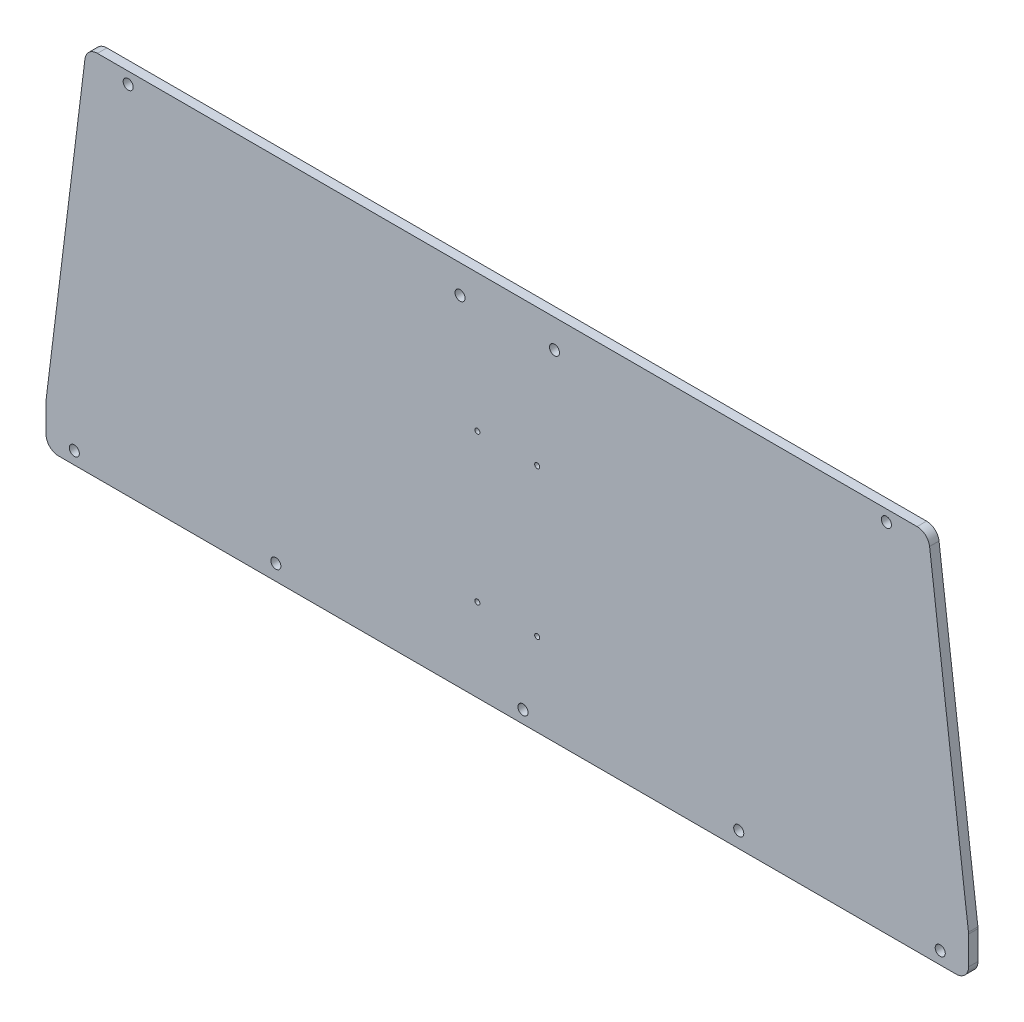
ISO-10303-21;
HEADER;
FILE_DESCRIPTION(('STEP AP214'),'2;1');
FILE_NAME('part.step','',(''),(''),'','','');
FILE_SCHEMA(('AUTOMOTIVE_DESIGN { 1 0 10303 214 1 1 1 1 }'));
ENDSEC;
DATA;
#1=APPLICATION_CONTEXT('core data for automotive mechanical design processes');
#2=APPLICATION_PROTOCOL_DEFINITION('international standard','automotive_design',2000,#1);
#3=PRODUCT_CONTEXT('',#1,'mechanical');
#4=PRODUCT('Part','Part','',(#3));
#5=PRODUCT_RELATED_PRODUCT_CATEGORY('part','',(#4));
#6=PRODUCT_DEFINITION_FORMATION('','',#4);
#7=PRODUCT_DEFINITION_CONTEXT('part definition',#1,'design');
#8=PRODUCT_DEFINITION('design','',#6,#7);
#9=PRODUCT_DEFINITION_SHAPE('','',#8);
#10=(LENGTH_UNIT() NAMED_UNIT(*) SI_UNIT(.MILLI.,.METRE.));
#11=(NAMED_UNIT(*) PLANE_ANGLE_UNIT() SI_UNIT($,.RADIAN.));
#12=(NAMED_UNIT(*) SI_UNIT($,.STERADIAN.) SOLID_ANGLE_UNIT());
#13=UNCERTAINTY_MEASURE_WITH_UNIT(LENGTH_MEASURE(1.E-05),#10,'distance_accuracy_value','');
#14=(GEOMETRIC_REPRESENTATION_CONTEXT(3) GLOBAL_UNCERTAINTY_ASSIGNED_CONTEXT((#13)) GLOBAL_UNIT_ASSIGNED_CONTEXT((#10,
#11,#12)) REPRESENTATION_CONTEXT('',''));
#15=CARTESIAN_POINT('',(0.,0.,0.));
#16=DIRECTION('',(0.,0.,1.));
#17=DIRECTION('',(1.,0.,0.));
#18=AXIS2_PLACEMENT_3D('',#15,#16,#17);
#19=CARTESIAN_POINT('',(-142.556822226775,-0.579261564720194,-3.));
#20=DIRECTION('',(0.,0.,1.));
#21=DIRECTION('',(1.,0.,0.));
#22=AXIS2_PLACEMENT_3D('',#19,#20,#21);
#23=ELLIPSE('',#22,4.,3.97598833634421);
#24=DIRECTION('',(0.,0.,1.));
#25=VECTOR('',#24,1.);
#26=SURFACE_OF_LINEAR_EXTRUSION('',#23,#25);
#27=CARTESIAN_POINT('',(-142.556822226775,-0.579261564720194,0.));
#28=DIRECTION('',(0.,0.,1.));
#29=DIRECTION('',(1.,0.,0.));
#30=AXIS2_PLACEMENT_3D('',#27,#28,#29);
#31=ELLIPSE('',#30,4.,3.97598833634421);
#32=CARTESIAN_POINT('',(-146.556822226775,-0.579261564720194,0.));
#33=VERTEX_POINT('',#32);
#34=CARTESIAN_POINT('',(-142.556822226775,-4.5552499010644,0.));
#35=VERTEX_POINT('',#34);
#36=EDGE_CURVE('E250',#33,#35,#31,.T.);
#37=ORIENTED_EDGE('',*,*,#36,.F.);
#38=DIRECTION('',(0.,0.,1.));
#39=VECTOR('',#38,1.);
#40=CARTESIAN_POINT('',(-146.556822226775,-0.579261564720194,-3.));
#41=LINE('',#40,#39);
#42=CARTESIAN_POINT('',(-146.556822226775,-0.579261564720194,-3.));
#43=VERTEX_POINT('',#42);
#44=EDGE_CURVE('E11',#43,#33,#41,.T.);
#45=ORIENTED_EDGE('',*,*,#44,.F.);
#46=CARTESIAN_POINT('',(-142.556822226775,-4.5552499010644,-3.));
#47=VERTEX_POINT('',#46);
#48=EDGE_CURVE('E251',#43,#47,#23,.T.);
#49=ORIENTED_EDGE('',*,*,#48,.T.);
#50=DIRECTION('',(0.,0.,1.));
#51=VECTOR('',#50,1.);
#52=CARTESIAN_POINT('',(-142.556822226775,-4.5552499010644,-3.));
#53=LINE('',#52,#51);
#54=EDGE_CURVE('E110',#47,#35,#53,.T.);
#55=ORIENTED_EDGE('',*,*,#54,.T.);
#56=EDGE_LOOP('',(#37,#45,#49,#55));
#57=FACE_BOUND('',#56,.T.);
#58=ADVANCED_FACE('F39',(#57),#26,.T.);
#59=CARTESIAN_POINT('',(-146.556822226775,8.46248460910281,-3.));
#60=DIRECTION('',(-1.,0.,0.));
#61=DIRECTION('',(0.,0.,1.));
#62=AXIS2_PLACEMENT_3D('',#59,#60,#61);
#63=PLANE('',#62);
#64=DIRECTION('',(0.,-1.,0.));
#65=VECTOR('',#64,1.);
#66=CARTESIAN_POINT('',(-146.556822226775,8.46248460910281,0.));
#67=LINE('',#66,#65);
#68=CARTESIAN_POINT('',(-146.556822226775,8.46248460910281,0.));
#69=VERTEX_POINT('',#68);
#70=EDGE_CURVE('E255',#69,#33,#67,.T.);
#71=ORIENTED_EDGE('',*,*,#70,.F.);
#72=DIRECTION('',(0.,0.,1.));
#73=VECTOR('',#72,1.);
#74=CARTESIAN_POINT('',(-146.556822226775,8.46248460910281,-3.));
#75=LINE('',#74,#73);
#76=CARTESIAN_POINT('',(-146.556822226775,8.46248460910281,-3.));
#77=VERTEX_POINT('',#76);
#78=EDGE_CURVE('E49',#77,#69,#75,.T.);
#79=ORIENTED_EDGE('',*,*,#78,.F.);
#80=DIRECTION('',(0.,-1.,0.));
#81=VECTOR('',#80,1.);
#82=CARTESIAN_POINT('',(-146.556822226775,8.46248460910281,-3.));
#83=LINE('',#82,#81);
#84=EDGE_CURVE('E156',#77,#43,#83,.T.);
#85=ORIENTED_EDGE('',*,*,#84,.T.);
#86=ORIENTED_EDGE('',*,*,#44,.T.);
#87=EDGE_LOOP('',(#71,#79,#85,#86));
#88=FACE_BOUND('',#87,.T.);
#89=ADVANCED_FACE('F172',(#88),#63,.T.);
#90=CARTESIAN_POINT('',(-142.556822226775,8.46248460910281,-3.));
#91=DIRECTION('',(0.,0.,1.));
#92=DIRECTION('',(1.,0.,0.));
#93=AXIS2_PLACEMENT_3D('',#90,#91,#92);
#94=ELLIPSE('',#93,4.,3.97598833634421);
#95=DIRECTION('',(0.,0.,1.));
#96=VECTOR('',#95,1.);
#97=SURFACE_OF_LINEAR_EXTRUSION('',#94,#96);
#98=CARTESIAN_POINT('',(-142.556822226775,8.46248460910281,0.));
#99=DIRECTION('',(0.,0.,1.));
#100=DIRECTION('',(1.,0.,0.));
#101=AXIS2_PLACEMENT_3D('',#98,#99,#100);
#102=ELLIPSE('',#101,4.,3.97598833634421);
#103=CARTESIAN_POINT('',(-146.52700683334,8.94703569703961,0.));
#104=VERTEX_POINT('',#103);
#105=EDGE_CURVE('E143',#104,#69,#102,.T.);
#106=ORIENTED_EDGE('',*,*,#105,.F.);
#107=DIRECTION('',(0.,0.,1.));
#108=VECTOR('',#107,1.);
#109=CARTESIAN_POINT('',(-146.52700683334,8.94703569703961,-3.));
#110=LINE('',#109,#108);
#111=CARTESIAN_POINT('',(-146.52700683334,8.94703569703961,-3.));
#112=VERTEX_POINT('',#111);
#113=EDGE_CURVE('E138',#112,#104,#110,.T.);
#114=ORIENTED_EDGE('',*,*,#113,.F.);
#115=EDGE_CURVE('E141',#112,#77,#94,.T.);
#116=ORIENTED_EDGE('',*,*,#115,.T.);
#117=ORIENTED_EDGE('',*,*,#78,.T.);
#118=EDGE_LOOP('',(#106,#114,#116,#117));
#119=FACE_BOUND('',#118,.T.);
#120=ADVANCED_FACE('F140',(#119),#97,.T.);
#121=CARTESIAN_POINT('',(-134.178039088322,108.917568146375,-3.));
#122=DIRECTION('',(-0.992456868880227,0.122594304159927,0.));
#123=DIRECTION('',(-0.122594304159927,-0.992456868880227,0.));
#124=AXIS2_PLACEMENT_3D('',#121,#122,#123);
#125=PLANE('',#124);
#126=DIRECTION('',(-0.122594304159927,-0.992456868880227,0.));
#127=VECTOR('',#126,1.);
#128=CARTESIAN_POINT('',(-134.178039088322,108.917568146375,0.));
#129=LINE('',#128,#127);
#130=CARTESIAN_POINT('',(-134.178039088322,108.917568146375,0.));
#131=VERTEX_POINT('',#130);
#132=EDGE_CURVE('E286',#131,#104,#129,.T.);
#133=ORIENTED_EDGE('',*,*,#132,.F.);
#134=DIRECTION('',(0.,0.,1.));
#135=VECTOR('',#134,1.);
#136=CARTESIAN_POINT('',(-134.178039088322,108.917568146375,-3.));
#137=LINE('',#136,#135);
#138=CARTESIAN_POINT('',(-134.178039088322,108.917568146375,-3.));
#139=VERTEX_POINT('',#138);
#140=EDGE_CURVE('E148',#139,#131,#137,.T.);
#141=ORIENTED_EDGE('',*,*,#140,.F.);
#142=DIRECTION('',(-0.122594304159927,-0.992456868880227,0.));
#143=VECTOR('',#142,1.);
#144=CARTESIAN_POINT('',(-134.178039088322,108.917568146375,-3.));
#145=LINE('',#144,#143);
#146=EDGE_CURVE('E154',#139,#112,#145,.T.);
#147=ORIENTED_EDGE('',*,*,#146,.T.);
#148=ORIENTED_EDGE('',*,*,#113,.T.);
#149=EDGE_LOOP('',(#133,#141,#147,#148));
#150=FACE_BOUND('',#149,.T.);
#151=ADVANCED_FACE('F158',(#150),#125,.T.);
#152=CARTESIAN_POINT('',(-130.207854481757,108.433017058438,-3.));
#153=DIRECTION('',(0.,0.,1.));
#154=DIRECTION('',(1.,0.,0.));
#155=AXIS2_PLACEMENT_3D('',#152,#153,#154);
#156=ELLIPSE('',#155,4.,3.9759883363442);
#157=DIRECTION('',(0.,0.,1.));
#158=VECTOR('',#157,1.);
#159=SURFACE_OF_LINEAR_EXTRUSION('',#156,#158);
#160=CARTESIAN_POINT('',(-130.207854481757,108.433017058438,0.));
#161=DIRECTION('',(0.,0.,1.));
#162=DIRECTION('',(1.,0.,0.));
#163=AXIS2_PLACEMENT_3D('',#160,#161,#162);
#164=ELLIPSE('',#163,4.,3.9759883363442);
#165=CARTESIAN_POINT('',(-130.207854481757,112.409005394783,0.));
#166=VERTEX_POINT('',#165);
#167=EDGE_CURVE('E208',#166,#131,#164,.T.);
#168=ORIENTED_EDGE('',*,*,#167,.F.);
#169=DIRECTION('',(0.,0.,1.));
#170=VECTOR('',#169,1.);
#171=CARTESIAN_POINT('',(-130.207854481757,112.409005394783,-3.));
#172=LINE('',#171,#170);
#173=CARTESIAN_POINT('',(-130.207854481757,112.409005394783,-3.));
#174=VERTEX_POINT('',#173);
#175=EDGE_CURVE('E202',#174,#166,#172,.T.);
#176=ORIENTED_EDGE('',*,*,#175,.F.);
#177=EDGE_CURVE('E159',#174,#139,#156,.T.);
#178=ORIENTED_EDGE('',*,*,#177,.T.);
#179=ORIENTED_EDGE('',*,*,#140,.T.);
#180=EDGE_LOOP('',(#168,#176,#178,#179));
#181=FACE_BOUND('',#180,.T.);
#182=ADVANCED_FACE('F176',(#181),#159,.T.);
#183=CARTESIAN_POINT('',(-11.6189500386223,112.409005394783,-3.));
#184=DIRECTION('',(0.,1.,0.));
#185=DIRECTION('',(-1.,0.,0.));
#186=AXIS2_PLACEMENT_3D('',#183,#184,#185);
#187=PLANE('',#186);
#188=DIRECTION('',(-1.,0.,0.));
#189=VECTOR('',#188,1.);
#190=CARTESIAN_POINT('',(-11.6189500386223,112.409005394783,0.));
#191=LINE('',#190,#189);
#192=CARTESIAN_POINT('',(130.207854481756,112.409005394783,0.));
#193=VERTEX_POINT('',#192);
#194=EDGE_CURVE('E292',#193,#166,#191,.T.);
#195=ORIENTED_EDGE('',*,*,#194,.F.);
#196=DIRECTION('',(0.,0.,1.));
#197=VECTOR('',#196,1.);
#198=CARTESIAN_POINT('',(130.207854481756,112.409005394783,-3.));
#199=LINE('',#198,#197);
#200=CARTESIAN_POINT('',(130.207854481756,112.409005394783,-3.));
#201=VERTEX_POINT('',#200);
#202=EDGE_CURVE('E205',#201,#193,#199,.T.);
#203=ORIENTED_EDGE('',*,*,#202,.F.);
#204=DIRECTION('',(-1.,0.,0.));
#205=VECTOR('',#204,1.);
#206=CARTESIAN_POINT('',(130.207854481756,112.409005394783,-3.));
#207=LINE('',#206,#205);
#208=EDGE_CURVE('E161',#201,#174,#207,.T.);
#209=ORIENTED_EDGE('',*,*,#208,.T.);
#210=ORIENTED_EDGE('',*,*,#175,.T.);
#211=EDGE_LOOP('',(#195,#203,#209,#210));
#212=FACE_BOUND('',#211,.T.);
#213=ADVANCED_FACE('F179',(#212),#187,.T.);
#214=CARTESIAN_POINT('',(130.207854481757,108.433017058438,-3.));
#215=DIRECTION('',(0.,0.,1.));
#216=DIRECTION('',(1.,0.,0.));
#217=AXIS2_PLACEMENT_3D('',#214,#215,#216);
#218=ELLIPSE('',#217,4.,3.9759883363442);
#219=DIRECTION('',(0.,0.,1.));
#220=VECTOR('',#219,1.);
#221=SURFACE_OF_LINEAR_EXTRUSION('',#218,#220);
#222=CARTESIAN_POINT('',(130.207854481757,108.433017058438,0.));
#223=DIRECTION('',(0.,0.,1.));
#224=DIRECTION('',(1.,0.,0.));
#225=AXIS2_PLACEMENT_3D('',#222,#223,#224);
#226=ELLIPSE('',#225,4.,3.9759883363442);
#227=CARTESIAN_POINT('',(134.178039088322,108.917568146375,0.));
#228=VERTEX_POINT('',#227);
#229=EDGE_CURVE('E295',#228,#193,#226,.T.);
#230=ORIENTED_EDGE('',*,*,#229,.F.);
#231=DIRECTION('',(0.,0.,1.));
#232=VECTOR('',#231,1.);
#233=CARTESIAN_POINT('',(134.178039088322,108.917568146375,-3.));
#234=LINE('',#233,#232);
#235=CARTESIAN_POINT('',(134.178039088322,108.917568146375,-3.));
#236=VERTEX_POINT('',#235);
#237=EDGE_CURVE('E213',#236,#228,#234,.T.);
#238=ORIENTED_EDGE('',*,*,#237,.F.);
#239=EDGE_CURVE('E191',#236,#201,#218,.T.);
#240=ORIENTED_EDGE('',*,*,#239,.T.);
#241=ORIENTED_EDGE('',*,*,#202,.T.);
#242=EDGE_LOOP('',(#230,#238,#240,#241));
#243=FACE_BOUND('',#242,.T.);
#244=ADVANCED_FACE('F183',(#243),#221,.T.);
#245=CARTESIAN_POINT('',(146.52700683334,8.9470356970396,-3.));
#246=DIRECTION('',(0.992456868880227,0.122594304159927,0.));
#247=DIRECTION('',(-0.122594304159927,0.992456868880227,0.));
#248=AXIS2_PLACEMENT_3D('',#245,#246,#247);
#249=PLANE('',#248);
#250=DIRECTION('',(-0.122594304159927,0.992456868880227,0.));
#251=VECTOR('',#250,1.);
#252=CARTESIAN_POINT('',(146.52700683334,8.9470356970396,0.));
#253=LINE('',#252,#251);
#254=CARTESIAN_POINT('',(146.52700683334,8.9470356970396,0.));
#255=VERTEX_POINT('',#254);
#256=EDGE_CURVE('E299',#255,#228,#253,.T.);
#257=ORIENTED_EDGE('',*,*,#256,.F.);
#258=DIRECTION('',(0.,0.,1.));
#259=VECTOR('',#258,1.);
#260=CARTESIAN_POINT('',(146.52700683334,8.9470356970396,-3.));
#261=LINE('',#260,#259);
#262=CARTESIAN_POINT('',(146.52700683334,8.9470356970396,-3.));
#263=VERTEX_POINT('',#262);
#264=EDGE_CURVE('E217',#263,#255,#261,.T.);
#265=ORIENTED_EDGE('',*,*,#264,.F.);
#266=DIRECTION('',(-0.122594304159927,0.992456868880227,0.));
#267=VECTOR('',#266,1.);
#268=CARTESIAN_POINT('',(146.52700683334,8.9470356970396,-3.));
#269=LINE('',#268,#267);
#270=EDGE_CURVE('E196',#263,#236,#269,.T.);
#271=ORIENTED_EDGE('',*,*,#270,.T.);
#272=ORIENTED_EDGE('',*,*,#237,.T.);
#273=EDGE_LOOP('',(#257,#265,#271,#272));
#274=FACE_BOUND('',#273,.T.);
#275=ADVANCED_FACE('F188',(#274),#249,.T.);
#276=CARTESIAN_POINT('',(142.556822226775,8.46248460910283,-3.));
#277=DIRECTION('',(0.,0.,1.));
#278=DIRECTION('',(1.,0.,0.));
#279=AXIS2_PLACEMENT_3D('',#276,#277,#278);
#280=ELLIPSE('',#279,4.,3.97598833634421);
#281=DIRECTION('',(0.,0.,1.));
#282=VECTOR('',#281,1.);
#283=SURFACE_OF_LINEAR_EXTRUSION('',#280,#282);
#284=CARTESIAN_POINT('',(142.556822226775,8.46248460910283,0.));
#285=DIRECTION('',(0.,0.,1.));
#286=DIRECTION('',(1.,0.,0.));
#287=AXIS2_PLACEMENT_3D('',#284,#285,#286);
#288=ELLIPSE('',#287,4.,3.97598833634421);
#289=CARTESIAN_POINT('',(146.556822226775,8.46248460910284,0.));
#290=VERTEX_POINT('',#289);
#291=EDGE_CURVE('E303',#290,#255,#288,.T.);
#292=ORIENTED_EDGE('',*,*,#291,.F.);
#293=DIRECTION('',(0.,0.,1.));
#294=VECTOR('',#293,1.);
#295=CARTESIAN_POINT('',(146.556822226775,8.46248460910284,-3.));
#296=LINE('',#295,#294);
#297=CARTESIAN_POINT('',(146.556822226775,8.46248460910284,-3.));
#298=VERTEX_POINT('',#297);
#299=EDGE_CURVE('E219',#298,#290,#296,.T.);
#300=ORIENTED_EDGE('',*,*,#299,.F.);
#301=EDGE_CURVE('E324',#298,#263,#280,.T.);
#302=ORIENTED_EDGE('',*,*,#301,.T.);
#303=ORIENTED_EDGE('',*,*,#264,.T.);
#304=EDGE_LOOP('',(#292,#300,#302,#303));
#305=FACE_BOUND('',#304,.T.);
#306=ADVANCED_FACE('F321',(#305),#283,.T.);
#307=CARTESIAN_POINT('',(146.556822226775,-0.579261564720142,-3.));
#308=DIRECTION('',(1.,0.,0.));
#309=DIRECTION('',(0.,1.,0.));
#310=AXIS2_PLACEMENT_3D('',#307,#308,#309);
#311=PLANE('',#310);
#312=DIRECTION('',(0.,1.,0.));
#313=VECTOR('',#312,1.);
#314=CARTESIAN_POINT('',(146.556822226775,-0.579261564720142,0.));
#315=LINE('',#314,#313);
#316=CARTESIAN_POINT('',(146.556822226775,-0.579261564720142,0.));
#317=VERTEX_POINT('',#316);
#318=EDGE_CURVE('E306',#317,#290,#315,.T.);
#319=ORIENTED_EDGE('',*,*,#318,.F.);
#320=DIRECTION('',(0.,0.,1.));
#321=VECTOR('',#320,1.);
#322=CARTESIAN_POINT('',(146.556822226775,-0.579261564720142,-3.));
#323=LINE('',#322,#321);
#324=CARTESIAN_POINT('',(146.556822226775,-0.579261564720142,-3.));
#325=VERTEX_POINT('',#324);
#326=EDGE_CURVE('E221',#325,#317,#323,.T.);
#327=ORIENTED_EDGE('',*,*,#326,.F.);
#328=DIRECTION('',(0.,1.,0.));
#329=VECTOR('',#328,1.);
#330=CARTESIAN_POINT('',(146.556822226775,-0.579261564720142,-3.));
#331=LINE('',#330,#329);
#332=EDGE_CURVE('E261',#325,#298,#331,.T.);
#333=ORIENTED_EDGE('',*,*,#332,.T.);
#334=ORIENTED_EDGE('',*,*,#299,.T.);
#335=EDGE_LOOP('',(#319,#327,#333,#334));
#336=FACE_BOUND('',#335,.T.);
#337=ADVANCED_FACE('F267',(#336),#311,.T.);
#338=CARTESIAN_POINT('',(142.556822226775,-0.579261564720159,-3.));
#339=DIRECTION('',(0.,0.,1.));
#340=DIRECTION('',(1.,0.,0.));
#341=AXIS2_PLACEMENT_3D('',#338,#339,#340);
#342=ELLIPSE('',#341,4.,3.97598833634421);
#343=DIRECTION('',(0.,0.,1.));
#344=VECTOR('',#343,1.);
#345=SURFACE_OF_LINEAR_EXTRUSION('',#342,#344);
#346=CARTESIAN_POINT('',(142.556822226775,-0.579261564720159,0.));
#347=DIRECTION('',(0.,0.,1.));
#348=DIRECTION('',(1.,0.,0.));
#349=AXIS2_PLACEMENT_3D('',#346,#347,#348);
#350=ELLIPSE('',#349,4.,3.97598833634421);
#351=CARTESIAN_POINT('',(142.556822226775,-4.55524990106437,0.));
#352=VERTEX_POINT('',#351);
#353=EDGE_CURVE('E309',#352,#317,#350,.T.);
#354=ORIENTED_EDGE('',*,*,#353,.F.);
#355=DIRECTION('',(0.,0.,1.));
#356=VECTOR('',#355,1.);
#357=CARTESIAN_POINT('',(142.556822226775,-4.55524990106437,-3.));
#358=LINE('',#357,#356);
#359=CARTESIAN_POINT('',(142.556822226775,-4.55524990106437,-3.));
#360=VERTEX_POINT('',#359);
#361=EDGE_CURVE('E223',#360,#352,#358,.T.);
#362=ORIENTED_EDGE('',*,*,#361,.F.);
#363=EDGE_CURVE('E257',#360,#325,#342,.T.);
#364=ORIENTED_EDGE('',*,*,#363,.T.);
#365=ORIENTED_EDGE('',*,*,#326,.T.);
#366=EDGE_LOOP('',(#354,#362,#364,#365));
#367=FACE_BOUND('',#366,.T.);
#368=ADVANCED_FACE('F263',(#367),#345,.T.);
#369=CARTESIAN_POINT('',(-142.556822226775,-4.5552499010644,-3.));
#370=DIRECTION('',(0.,-1.,0.));
#371=DIRECTION('',(1.,0.,0.));
#372=AXIS2_PLACEMENT_3D('',#369,#370,#371);
#373=PLANE('',#372);
#374=DIRECTION('',(1.,0.,0.));
#375=VECTOR('',#374,1.);
#376=CARTESIAN_POINT('',(-142.556822226775,-4.5552499010644,0.));
#377=LINE('',#376,#375);
#378=EDGE_CURVE('E284',#35,#352,#377,.T.);
#379=ORIENTED_EDGE('',*,*,#378,.F.);
#380=ORIENTED_EDGE('',*,*,#54,.F.);
#381=DIRECTION('',(1.,0.,0.));
#382=VECTOR('',#381,1.);
#383=CARTESIAN_POINT('',(-142.556822226775,-4.5552499010644,-3.));
#384=LINE('',#383,#382);
#385=EDGE_CURVE('E254',#47,#360,#384,.T.);
#386=ORIENTED_EDGE('',*,*,#385,.T.);
#387=ORIENTED_EDGE('',*,*,#361,.T.);
#388=EDGE_LOOP('',(#379,#380,#386,#387));
#389=FACE_BOUND('',#388,.T.);
#390=ADVANCED_FACE('F266',(#389),#373,.T.);
#391=CARTESIAN_POINT('',(-142.556822226775,-0.579261564720194,-3.));
#392=DIRECTION('',(0.,0.,1.));
#393=DIRECTION('',(1.,0.,0.));
#394=AXIS2_PLACEMENT_3D('',#391,#392,#393);
#395=PLANE('',#394);
#396=CARTESIAN_POINT('',(-9.50000000000003,68.8090053947826,-3.));
#397=DIRECTION('',(0.,0.,1.));
#398=DIRECTION('',(1.,0.,0.));
#399=AXIS2_PLACEMENT_3D('',#396,#397,#398);
#400=CIRCLE('',#399,0.799999999999998);
#401=CARTESIAN_POINT('',(-8.70000000000003,68.8090053947826,-3.));
#402=VERTEX_POINT('',#401);
#403=EDGE_CURVE('E557',#402,#402,#400,.T.);
#404=ORIENTED_EDGE('',*,*,#403,.T.);
#405=EDGE_LOOP('',(#404));
#406=FACE_BOUND('',#405,.T.);
#407=CARTESIAN_POINT('',(9.49999999999997,68.8090053947826,-3.));
#408=DIRECTION('',(0.,0.,1.));
#409=DIRECTION('',(1.,0.,0.));
#410=AXIS2_PLACEMENT_3D('',#407,#408,#409);
#411=CIRCLE('',#410,0.799999999999998);
#412=CARTESIAN_POINT('',(10.3,68.8090053947826,-3.));
#413=VERTEX_POINT('',#412);
#414=EDGE_CURVE('E561',#413,#413,#411,.T.);
#415=ORIENTED_EDGE('',*,*,#414,.T.);
#416=EDGE_LOOP('',(#415));
#417=FACE_BOUND('',#416,.T.);
#418=CARTESIAN_POINT('',(-9.50000000000001,21.8090053947826,-3.));
#419=DIRECTION('',(0.,0.,1.));
#420=DIRECTION('',(1.,0.,0.));
#421=AXIS2_PLACEMENT_3D('',#418,#419,#420);
#422=CIRCLE('',#421,0.799999999999998);
#423=CARTESIAN_POINT('',(-8.70000000000001,21.8090053947826,-3.));
#424=VERTEX_POINT('',#423);
#425=EDGE_CURVE('E570',#424,#424,#422,.T.);
#426=ORIENTED_EDGE('',*,*,#425,.T.);
#427=EDGE_LOOP('',(#426));
#428=FACE_BOUND('',#427,.T.);
#429=CARTESIAN_POINT('',(9.49999999999998,21.8090053947826,-3.));
#430=DIRECTION('',(0.,0.,1.));
#431=DIRECTION('',(1.,0.,0.));
#432=AXIS2_PLACEMENT_3D('',#429,#430,#431);
#433=CIRCLE('',#432,0.799999999999998);
#434=CARTESIAN_POINT('',(10.3,21.8090053947826,-3.));
#435=VERTEX_POINT('',#434);
#436=EDGE_CURVE('E576',#435,#435,#433,.T.);
#437=ORIENTED_EDGE('',*,*,#436,.T.);
#438=EDGE_LOOP('',(#437));
#439=FACE_BOUND('',#438,.T.);
#440=CARTESIAN_POINT('',(120.448684545386,108.772293039448,-3.));
#441=DIRECTION('',(0.,0.,1.));
#442=DIRECTION('',(1.,0.,0.));
#443=AXIS2_PLACEMENT_3D('',#440,#441,#442);
#444=CIRCLE('',#443,1.6);
#445=CARTESIAN_POINT('',(122.048684545386,108.772293039448,-3.));
#446=VERTEX_POINT('',#445);
#447=EDGE_CURVE('E583',#446,#446,#444,.T.);
#448=ORIENTED_EDGE('',*,*,#447,.T.);
#449=EDGE_LOOP('',(#448));
#450=FACE_BOUND('',#449,.T.);
#451=CARTESIAN_POINT('',(137.556822226775,-0.579261564720157,-3.));
#452=DIRECTION('',(0.,0.,1.));
#453=DIRECTION('',(1.,0.,0.));
#454=AXIS2_PLACEMENT_3D('',#451,#452,#453);
#455=CIRCLE('',#454,1.59999999999999);
#456=CARTESIAN_POINT('',(139.156822226775,-0.579261564720157,-3.));
#457=VERTEX_POINT('',#456);
#458=EDGE_CURVE('E590',#457,#457,#455,.T.);
#459=ORIENTED_EDGE('',*,*,#458,.T.);
#460=EDGE_LOOP('',(#459));
#461=FACE_BOUND('',#460,.T.);
#462=CARTESIAN_POINT('',(73.5382034500026,0.414735519365883,-3.));
#463=DIRECTION('',(0.,0.,1.));
#464=DIRECTION('',(1.,0.,0.));
#465=AXIS2_PLACEMENT_3D('',#462,#463,#464);
#466=CIRCLE('',#465,1.6);
#467=CARTESIAN_POINT('',(75.1382034500026,0.414735519365883,-3.));
#468=VERTEX_POINT('',#467);
#469=EDGE_CURVE('E596',#468,#468,#466,.T.);
#470=ORIENTED_EDGE('',*,*,#469,.T.);
#471=EDGE_LOOP('',(#470));
#472=FACE_BOUND('',#471,.T.);
#473=CARTESIAN_POINT('',(-73.5382034500026,0.414735519365869,-3.));
#474=DIRECTION('',(0.,0.,1.));
#475=DIRECTION('',(1.,0.,0.));
#476=AXIS2_PLACEMENT_3D('',#473,#474,#475);
#477=CIRCLE('',#476,1.6);
#478=CARTESIAN_POINT('',(-71.9382034500026,0.414735519365869,-3.));
#479=VERTEX_POINT('',#478);
#480=EDGE_CURVE('E602',#479,#479,#477,.T.);
#481=ORIENTED_EDGE('',*,*,#480,.T.);
#482=EDGE_LOOP('',(#481));
#483=FACE_BOUND('',#482,.T.);
#484=CARTESIAN_POINT('',(-137.556822226775,-0.579261564720199,-3.));
#485=DIRECTION('',(0.,0.,1.));
#486=DIRECTION('',(1.,0.,0.));
#487=AXIS2_PLACEMENT_3D('',#484,#485,#486);
#488=CIRCLE('',#487,1.59999999999999);
#489=CARTESIAN_POINT('',(-135.956822226775,-0.579261564720199,-3.));
#490=VERTEX_POINT('',#489);
#491=EDGE_CURVE('E607',#490,#490,#488,.T.);
#492=ORIENTED_EDGE('',*,*,#491,.T.);
#493=EDGE_LOOP('',(#492));
#494=FACE_BOUND('',#493,.T.);
#495=CARTESIAN_POINT('',(-120.448684545386,108.772293039448,-3.));
#496=DIRECTION('',(0.,0.,1.));
#497=DIRECTION('',(1.,0.,0.));
#498=AXIS2_PLACEMENT_3D('',#495,#496,#497);
#499=CIRCLE('',#498,1.6);
#500=CARTESIAN_POINT('',(-118.848684545386,108.772293039448,-3.));
#501=VERTEX_POINT('',#500);
#502=EDGE_CURVE('E43',#501,#501,#499,.T.);
#503=ORIENTED_EDGE('',*,*,#502,.T.);
#504=EDGE_LOOP('',(#503));
#505=FACE_BOUND('',#504,.T.);
#506=CARTESIAN_POINT('',(-15.,103.409005394783,-3.));
#507=DIRECTION('',(0.,0.,1.));
#508=DIRECTION('',(1.,0.,0.));
#509=AXIS2_PLACEMENT_3D('',#506,#507,#508);
#510=CIRCLE('',#509,1.6);
#511=CARTESIAN_POINT('',(-13.4,103.409005394783,-3.));
#512=VERTEX_POINT('',#511);
#513=EDGE_CURVE('E225',#512,#512,#510,.T.);
#514=ORIENTED_EDGE('',*,*,#513,.T.);
#515=EDGE_LOOP('',(#514));
#516=FACE_BOUND('',#515,.T.);
#517=CARTESIAN_POINT('',(15.,103.409005394783,-3.));
#518=DIRECTION('',(0.,0.,1.));
#519=DIRECTION('',(1.,0.,0.));
#520=AXIS2_PLACEMENT_3D('',#517,#518,#519);
#521=CIRCLE('',#520,1.6);
#522=CARTESIAN_POINT('',(16.6,103.409005394783,-3.));
#523=VERTEX_POINT('',#522);
#524=EDGE_CURVE('E232',#523,#523,#521,.T.);
#525=ORIENTED_EDGE('',*,*,#524,.T.);
#526=EDGE_LOOP('',(#525));
#527=FACE_BOUND('',#526,.T.);
#528=CARTESIAN_POINT('',(5.00000000000003,-0.579261564720157,-3.));
#529=DIRECTION('',(0.,0.,1.));
#530=DIRECTION('',(1.,0.,0.));
#531=AXIS2_PLACEMENT_3D('',#528,#529,#530);
#532=CIRCLE('',#531,1.6);
#533=CARTESIAN_POINT('',(6.60000000000003,-0.579261564720157,-3.));
#534=VERTEX_POINT('',#533);
#535=EDGE_CURVE('E248',#534,#534,#532,.T.);
#536=ORIENTED_EDGE('',*,*,#535,.T.);
#537=EDGE_LOOP('',(#536));
#538=FACE_BOUND('',#537,.T.);
#539=ORIENTED_EDGE('',*,*,#48,.F.);
#540=ORIENTED_EDGE('',*,*,#84,.F.);
#541=ORIENTED_EDGE('',*,*,#115,.F.);
#542=ORIENTED_EDGE('',*,*,#146,.F.);
#543=ORIENTED_EDGE('',*,*,#177,.F.);
#544=ORIENTED_EDGE('',*,*,#208,.F.);
#545=ORIENTED_EDGE('',*,*,#239,.F.);
#546=ORIENTED_EDGE('',*,*,#270,.F.);
#547=ORIENTED_EDGE('',*,*,#301,.F.);
#548=ORIENTED_EDGE('',*,*,#332,.F.);
#549=ORIENTED_EDGE('',*,*,#363,.F.);
#550=ORIENTED_EDGE('',*,*,#385,.F.);
#551=EDGE_LOOP('',(#539,#540,#541,#542,#543,#544,#545,#546,#547,#548,#549,#550));
#552=FACE_BOUND('',#551,.T.);
#553=ADVANCED_FACE('F152',(#406,#417,#428,#439,#450,#461,#472,#483,#494,#505,#516,#527,#538,
#552),#395,.F.);
#554=CARTESIAN_POINT('',(-142.556822226775,-0.579261564720194,0.));
#555=DIRECTION('',(0.,0.,1.));
#556=DIRECTION('',(1.,0.,0.));
#557=AXIS2_PLACEMENT_3D('',#554,#555,#556);
#558=PLANE('',#557);
#559=CARTESIAN_POINT('',(-9.50000000000003,68.8090053947826,0.));
#560=DIRECTION('',(0.,0.,1.));
#561=DIRECTION('',(1.,0.,0.));
#562=AXIS2_PLACEMENT_3D('',#559,#560,#561);
#563=CIRCLE('',#562,0.799999999999999);
#564=CARTESIAN_POINT('',(-8.70000000000003,68.8090053947826,0.));
#565=VERTEX_POINT('',#564);
#566=EDGE_CURVE('E554',#565,#565,#563,.T.);
#567=ORIENTED_EDGE('',*,*,#566,.F.);
#568=EDGE_LOOP('',(#567));
#569=FACE_BOUND('',#568,.T.);
#570=CARTESIAN_POINT('',(9.49999999999997,68.8090053947826,0.));
#571=DIRECTION('',(0.,0.,1.));
#572=DIRECTION('',(1.,0.,0.));
#573=AXIS2_PLACEMENT_3D('',#570,#571,#572);
#574=CIRCLE('',#573,0.799999999999999);
#575=CARTESIAN_POINT('',(10.3,68.8090053947826,0.));
#576=VERTEX_POINT('',#575);
#577=EDGE_CURVE('E558',#576,#576,#574,.T.);
#578=ORIENTED_EDGE('',*,*,#577,.F.);
#579=EDGE_LOOP('',(#578));
#580=FACE_BOUND('',#579,.T.);
#581=CARTESIAN_POINT('',(-9.50000000000001,21.8090053947826,0.));
#582=DIRECTION('',(0.,0.,1.));
#583=DIRECTION('',(1.,0.,0.));
#584=AXIS2_PLACEMENT_3D('',#581,#582,#583);
#585=CIRCLE('',#584,0.799999999999999);
#586=CARTESIAN_POINT('',(-8.70000000000001,21.8090053947826,0.));
#587=VERTEX_POINT('',#586);
#588=EDGE_CURVE('E567',#587,#587,#585,.T.);
#589=ORIENTED_EDGE('',*,*,#588,.F.);
#590=EDGE_LOOP('',(#589));
#591=FACE_BOUND('',#590,.T.);
#592=CARTESIAN_POINT('',(9.49999999999998,21.8090053947826,0.));
#593=DIRECTION('',(0.,0.,1.));
#594=DIRECTION('',(1.,0.,0.));
#595=AXIS2_PLACEMENT_3D('',#592,#593,#594);
#596=CIRCLE('',#595,0.799999999999999);
#597=CARTESIAN_POINT('',(10.3,21.8090053947826,0.));
#598=VERTEX_POINT('',#597);
#599=EDGE_CURVE('E573',#598,#598,#596,.T.);
#600=ORIENTED_EDGE('',*,*,#599,.F.);
#601=EDGE_LOOP('',(#600));
#602=FACE_BOUND('',#601,.T.);
#603=CARTESIAN_POINT('',(120.448684545386,108.772293039448,0.));
#604=DIRECTION('',(0.,0.,1.));
#605=DIRECTION('',(1.,0.,0.));
#606=AXIS2_PLACEMENT_3D('',#603,#604,#605);
#607=CIRCLE('',#606,1.6);
#608=CARTESIAN_POINT('',(122.048684545386,108.772293039448,0.));
#609=VERTEX_POINT('',#608);
#610=EDGE_CURVE('E579',#609,#609,#607,.T.);
#611=ORIENTED_EDGE('',*,*,#610,.F.);
#612=EDGE_LOOP('',(#611));
#613=FACE_BOUND('',#612,.T.);
#614=CARTESIAN_POINT('',(137.556822226775,-0.579261564720157,0.));
#615=DIRECTION('',(0.,0.,1.));
#616=DIRECTION('',(1.,0.,0.));
#617=AXIS2_PLACEMENT_3D('',#614,#615,#616);
#618=CIRCLE('',#617,1.59999999999999);
#619=CARTESIAN_POINT('',(139.156822226775,-0.579261564720157,0.));
#620=VERTEX_POINT('',#619);
#621=EDGE_CURVE('E587',#620,#620,#618,.T.);
#622=ORIENTED_EDGE('',*,*,#621,.F.);
#623=EDGE_LOOP('',(#622));
#624=FACE_BOUND('',#623,.T.);
#625=CARTESIAN_POINT('',(73.5382034500026,0.414735519365883,0.));
#626=DIRECTION('',(0.,0.,1.));
#627=DIRECTION('',(1.,0.,0.));
#628=AXIS2_PLACEMENT_3D('',#625,#626,#627);
#629=CIRCLE('',#628,1.6);
#630=CARTESIAN_POINT('',(75.1382034500026,0.414735519365883,0.));
#631=VERTEX_POINT('',#630);
#632=EDGE_CURVE('E593',#631,#631,#629,.T.);
#633=ORIENTED_EDGE('',*,*,#632,.F.);
#634=EDGE_LOOP('',(#633));
#635=FACE_BOUND('',#634,.T.);
#636=CARTESIAN_POINT('',(-73.5382034500026,0.414735519365869,0.));
#637=DIRECTION('',(0.,0.,1.));
#638=DIRECTION('',(1.,0.,0.));
#639=AXIS2_PLACEMENT_3D('',#636,#637,#638);
#640=CIRCLE('',#639,1.6);
#641=CARTESIAN_POINT('',(-71.9382034500026,0.414735519365869,0.));
#642=VERTEX_POINT('',#641);
#643=EDGE_CURVE('E599',#642,#642,#640,.T.);
#644=ORIENTED_EDGE('',*,*,#643,.F.);
#645=EDGE_LOOP('',(#644));
#646=FACE_BOUND('',#645,.T.);
#647=CARTESIAN_POINT('',(-137.556822226775,-0.579261564720199,0.));
#648=DIRECTION('',(0.,0.,1.));
#649=DIRECTION('',(1.,0.,0.));
#650=AXIS2_PLACEMENT_3D('',#647,#648,#649);
#651=CIRCLE('',#650,1.59999999999999);
#652=CARTESIAN_POINT('',(-135.956822226775,-0.579261564720199,0.));
#653=VERTEX_POINT('',#652);
#654=EDGE_CURVE('E605',#653,#653,#651,.T.);
#655=ORIENTED_EDGE('',*,*,#654,.F.);
#656=EDGE_LOOP('',(#655));
#657=FACE_BOUND('',#656,.T.);
#658=CARTESIAN_POINT('',(-120.448684545386,108.772293039448,0.));
#659=DIRECTION('',(0.,0.,1.));
#660=DIRECTION('',(1.,0.,0.));
#661=AXIS2_PLACEMENT_3D('',#658,#659,#660);
#662=CIRCLE('',#661,1.6);
#663=CARTESIAN_POINT('',(-118.848684545386,108.772293039448,0.));
#664=VERTEX_POINT('',#663);
#665=EDGE_CURVE('E239',#664,#664,#662,.T.);
#666=ORIENTED_EDGE('',*,*,#665,.F.);
#667=EDGE_LOOP('',(#666));
#668=FACE_BOUND('',#667,.T.);
#669=CARTESIAN_POINT('',(-15.,103.409005394783,0.));
#670=DIRECTION('',(0.,0.,1.));
#671=DIRECTION('',(1.,0.,0.));
#672=AXIS2_PLACEMENT_3D('',#669,#670,#671);
#673=CIRCLE('',#672,1.6);
#674=CARTESIAN_POINT('',(-13.4,103.409005394783,0.));
#675=VERTEX_POINT('',#674);
#676=EDGE_CURVE('E228',#675,#675,#673,.T.);
#677=ORIENTED_EDGE('',*,*,#676,.F.);
#678=EDGE_LOOP('',(#677));
#679=FACE_BOUND('',#678,.T.);
#680=CARTESIAN_POINT('',(15.,103.409005394783,0.));
#681=DIRECTION('',(0.,0.,1.));
#682=DIRECTION('',(1.,0.,0.));
#683=AXIS2_PLACEMENT_3D('',#680,#681,#682);
#684=CIRCLE('',#683,1.6);
#685=CARTESIAN_POINT('',(16.6,103.409005394783,0.));
#686=VERTEX_POINT('',#685);
#687=EDGE_CURVE('E227',#686,#686,#684,.T.);
#688=ORIENTED_EDGE('',*,*,#687,.F.);
#689=EDGE_LOOP('',(#688));
#690=FACE_BOUND('',#689,.T.);
#691=CARTESIAN_POINT('',(5.00000000000003,-0.579261564720157,0.));
#692=DIRECTION('',(0.,0.,1.));
#693=DIRECTION('',(1.,0.,0.));
#694=AXIS2_PLACEMENT_3D('',#691,#692,#693);
#695=CIRCLE('',#694,1.6);
#696=CARTESIAN_POINT('',(6.60000000000003,-0.579261564720157,0.));
#697=VERTEX_POINT('',#696);
#698=EDGE_CURVE('E245',#697,#697,#695,.T.);
#699=ORIENTED_EDGE('',*,*,#698,.F.);
#700=EDGE_LOOP('',(#699));
#701=FACE_BOUND('',#700,.T.);
#702=ORIENTED_EDGE('',*,*,#36,.T.);
#703=ORIENTED_EDGE('',*,*,#378,.T.);
#704=ORIENTED_EDGE('',*,*,#353,.T.);
#705=ORIENTED_EDGE('',*,*,#318,.T.);
#706=ORIENTED_EDGE('',*,*,#291,.T.);
#707=ORIENTED_EDGE('',*,*,#256,.T.);
#708=ORIENTED_EDGE('',*,*,#229,.T.);
#709=ORIENTED_EDGE('',*,*,#194,.T.);
#710=ORIENTED_EDGE('',*,*,#167,.T.);
#711=ORIENTED_EDGE('',*,*,#132,.T.);
#712=ORIENTED_EDGE('',*,*,#105,.T.);
#713=ORIENTED_EDGE('',*,*,#70,.T.);
#714=EDGE_LOOP('',(#702,#703,#704,#705,#706,#707,#708,#709,#710,#711,#712,#713));
#715=FACE_BOUND('',#714,.T.);
#716=ADVANCED_FACE('F273',(#569,#580,#591,#602,#613,#624,#635,#646,#657,#668,#679,#690,#701,
#715),#558,.T.);
#717=CARTESIAN_POINT('',(5.00000000000003,-0.579261564720157,0.));
#718=DIRECTION('',(0.,0.,1.));
#719=DIRECTION('',(1.,0.,0.));
#720=AXIS2_PLACEMENT_3D('',#717,#718,#719);
#721=CYLINDRICAL_SURFACE('',#720,1.6);
#722=ORIENTED_EDGE('',*,*,#698,.T.);
#723=EDGE_LOOP('',(#722));
#724=FACE_BOUND('',#723,.T.);
#725=ORIENTED_EDGE('',*,*,#535,.F.);
#726=EDGE_LOOP('',(#725));
#727=FACE_BOUND('',#726,.T.);
#728=ADVANCED_FACE('F420',(#724,#727),#721,.F.);
#729=CARTESIAN_POINT('',(15.,103.409005394783,0.));
#730=DIRECTION('',(0.,0.,1.));
#731=DIRECTION('',(1.,0.,0.));
#732=AXIS2_PLACEMENT_3D('',#729,#730,#731);
#733=CYLINDRICAL_SURFACE('',#732,1.6);
#734=ORIENTED_EDGE('',*,*,#687,.T.);
#735=EDGE_LOOP('',(#734));
#736=FACE_BOUND('',#735,.T.);
#737=ORIENTED_EDGE('',*,*,#524,.F.);
#738=EDGE_LOOP('',(#737));
#739=FACE_BOUND('',#738,.T.);
#740=ADVANCED_FACE('F429',(#736,#739),#733,.F.);
#741=CARTESIAN_POINT('',(-15.,103.409005394783,0.));
#742=DIRECTION('',(0.,0.,1.));
#743=DIRECTION('',(1.,0.,0.));
#744=AXIS2_PLACEMENT_3D('',#741,#742,#743);
#745=CYLINDRICAL_SURFACE('',#744,1.6);
#746=ORIENTED_EDGE('',*,*,#676,.T.);
#747=EDGE_LOOP('',(#746));
#748=FACE_BOUND('',#747,.T.);
#749=ORIENTED_EDGE('',*,*,#513,.F.);
#750=EDGE_LOOP('',(#749));
#751=FACE_BOUND('',#750,.T.);
#752=ADVANCED_FACE('F438',(#748,#751),#745,.F.);
#753=CARTESIAN_POINT('',(-120.448684545386,108.772293039448,0.));
#754=DIRECTION('',(0.,0.,1.));
#755=DIRECTION('',(1.,0.,0.));
#756=AXIS2_PLACEMENT_3D('',#753,#754,#755);
#757=CYLINDRICAL_SURFACE('',#756,1.6);
#758=ORIENTED_EDGE('',*,*,#665,.T.);
#759=EDGE_LOOP('',(#758));
#760=FACE_BOUND('',#759,.T.);
#761=ORIENTED_EDGE('',*,*,#502,.F.);
#762=EDGE_LOOP('',(#761));
#763=FACE_BOUND('',#762,.T.);
#764=ADVANCED_FACE('F447',(#760,#763),#757,.F.);
#765=CARTESIAN_POINT('',(-137.556822226775,-0.579261564720199,0.));
#766=DIRECTION('',(0.,0.,1.));
#767=DIRECTION('',(1.,0.,0.));
#768=AXIS2_PLACEMENT_3D('',#765,#766,#767);
#769=CYLINDRICAL_SURFACE('',#768,1.59999999999999);
#770=ORIENTED_EDGE('',*,*,#654,.T.);
#771=EDGE_LOOP('',(#770));
#772=FACE_BOUND('',#771,.T.);
#773=ORIENTED_EDGE('',*,*,#491,.F.);
#774=EDGE_LOOP('',(#773));
#775=FACE_BOUND('',#774,.T.);
#776=ADVANCED_FACE('F455',(#772,#775),#769,.F.);
#777=CARTESIAN_POINT('',(-73.5382034500026,0.414735519365869,0.));
#778=DIRECTION('',(0.,0.,1.));
#779=DIRECTION('',(1.,0.,0.));
#780=AXIS2_PLACEMENT_3D('',#777,#778,#779);
#781=CYLINDRICAL_SURFACE('',#780,1.6);
#782=ORIENTED_EDGE('',*,*,#643,.T.);
#783=EDGE_LOOP('',(#782));
#784=FACE_BOUND('',#783,.T.);
#785=ORIENTED_EDGE('',*,*,#480,.F.);
#786=EDGE_LOOP('',(#785));
#787=FACE_BOUND('',#786,.T.);
#788=ADVANCED_FACE('F464',(#784,#787),#781,.F.);
#789=CARTESIAN_POINT('',(73.5382034500026,0.414735519365883,0.));
#790=DIRECTION('',(0.,0.,1.));
#791=DIRECTION('',(1.,0.,0.));
#792=AXIS2_PLACEMENT_3D('',#789,#790,#791);
#793=CYLINDRICAL_SURFACE('',#792,1.6);
#794=ORIENTED_EDGE('',*,*,#632,.T.);
#795=EDGE_LOOP('',(#794));
#796=FACE_BOUND('',#795,.T.);
#797=ORIENTED_EDGE('',*,*,#469,.F.);
#798=EDGE_LOOP('',(#797));
#799=FACE_BOUND('',#798,.T.);
#800=ADVANCED_FACE('F473',(#796,#799),#793,.F.);
#801=CARTESIAN_POINT('',(137.556822226775,-0.579261564720157,0.));
#802=DIRECTION('',(0.,0.,1.));
#803=DIRECTION('',(1.,0.,0.));
#804=AXIS2_PLACEMENT_3D('',#801,#802,#803);
#805=CYLINDRICAL_SURFACE('',#804,1.59999999999999);
#806=ORIENTED_EDGE('',*,*,#621,.T.);
#807=EDGE_LOOP('',(#806));
#808=FACE_BOUND('',#807,.T.);
#809=ORIENTED_EDGE('',*,*,#458,.F.);
#810=EDGE_LOOP('',(#809));
#811=FACE_BOUND('',#810,.T.);
#812=ADVANCED_FACE('F482',(#808,#811),#805,.F.);
#813=CARTESIAN_POINT('',(120.448684545386,108.772293039448,0.));
#814=DIRECTION('',(0.,0.,1.));
#815=DIRECTION('',(1.,0.,0.));
#816=AXIS2_PLACEMENT_3D('',#813,#814,#815);
#817=CYLINDRICAL_SURFACE('',#816,1.6);
#818=ORIENTED_EDGE('',*,*,#610,.T.);
#819=EDGE_LOOP('',(#818));
#820=FACE_BOUND('',#819,.T.);
#821=ORIENTED_EDGE('',*,*,#447,.F.);
#822=EDGE_LOOP('',(#821));
#823=FACE_BOUND('',#822,.T.);
#824=ADVANCED_FACE('F491',(#820,#823),#817,.F.);
#825=CARTESIAN_POINT('',(9.49999999999998,21.8090053947826,0.));
#826=DIRECTION('',(0.,0.,1.));
#827=DIRECTION('',(1.,0.,0.));
#828=AXIS2_PLACEMENT_3D('',#825,#826,#827);
#829=CYLINDRICAL_SURFACE('',#828,0.799999999999998);
#830=ORIENTED_EDGE('',*,*,#599,.T.);
#831=EDGE_LOOP('',(#830));
#832=FACE_BOUND('',#831,.T.);
#833=ORIENTED_EDGE('',*,*,#436,.F.);
#834=EDGE_LOOP('',(#833));
#835=FACE_BOUND('',#834,.T.);
#836=ADVANCED_FACE('F499',(#832,#835),#829,.F.);
#837=CARTESIAN_POINT('',(-9.50000000000001,21.8090053947826,0.));
#838=DIRECTION('',(0.,0.,1.));
#839=DIRECTION('',(1.,0.,0.));
#840=AXIS2_PLACEMENT_3D('',#837,#838,#839);
#841=CYLINDRICAL_SURFACE('',#840,0.799999999999998);
#842=ORIENTED_EDGE('',*,*,#588,.T.);
#843=EDGE_LOOP('',(#842));
#844=FACE_BOUND('',#843,.T.);
#845=ORIENTED_EDGE('',*,*,#425,.F.);
#846=EDGE_LOOP('',(#845));
#847=FACE_BOUND('',#846,.T.);
#848=ADVANCED_FACE('F507',(#844,#847),#841,.F.);
#849=CARTESIAN_POINT('',(9.49999999999997,68.8090053947826,0.));
#850=DIRECTION('',(0.,0.,1.));
#851=DIRECTION('',(1.,0.,0.));
#852=AXIS2_PLACEMENT_3D('',#849,#850,#851);
#853=CYLINDRICAL_SURFACE('',#852,0.799999999999998);
#854=ORIENTED_EDGE('',*,*,#577,.T.);
#855=EDGE_LOOP('',(#854));
#856=FACE_BOUND('',#855,.T.);
#857=ORIENTED_EDGE('',*,*,#414,.F.);
#858=EDGE_LOOP('',(#857));
#859=FACE_BOUND('',#858,.T.);
#860=ADVANCED_FACE('F516',(#856,#859),#853,.F.);
#861=CARTESIAN_POINT('',(-9.50000000000003,68.8090053947826,0.));
#862=DIRECTION('',(0.,0.,1.));
#863=DIRECTION('',(1.,0.,0.));
#864=AXIS2_PLACEMENT_3D('',#861,#862,#863);
#865=CYLINDRICAL_SURFACE('',#864,0.799999999999998);
#866=ORIENTED_EDGE('',*,*,#566,.T.);
#867=EDGE_LOOP('',(#866));
#868=FACE_BOUND('',#867,.T.);
#869=ORIENTED_EDGE('',*,*,#403,.F.);
#870=EDGE_LOOP('',(#869));
#871=FACE_BOUND('',#870,.T.);
#872=ADVANCED_FACE('F525',(#868,#871),#865,.F.);
#873=CLOSED_SHELL('',(#58,#89,#120,#151,#182,#213,#244,#275,#306,#337,#368,#390,#553,#716,#728,
#740,#752,#764,#776,#788,#800,#812,#824,#836,#848,#860,#872));
#874=MANIFOLD_SOLID_BREP('B2',#873);
#875=ADVANCED_BREP_SHAPE_REPRESENTATION('',(#18,#874),#14);
#876=SHAPE_DEFINITION_REPRESENTATION(#9,#875);
ENDSEC;
END-ISO-10303-21;
